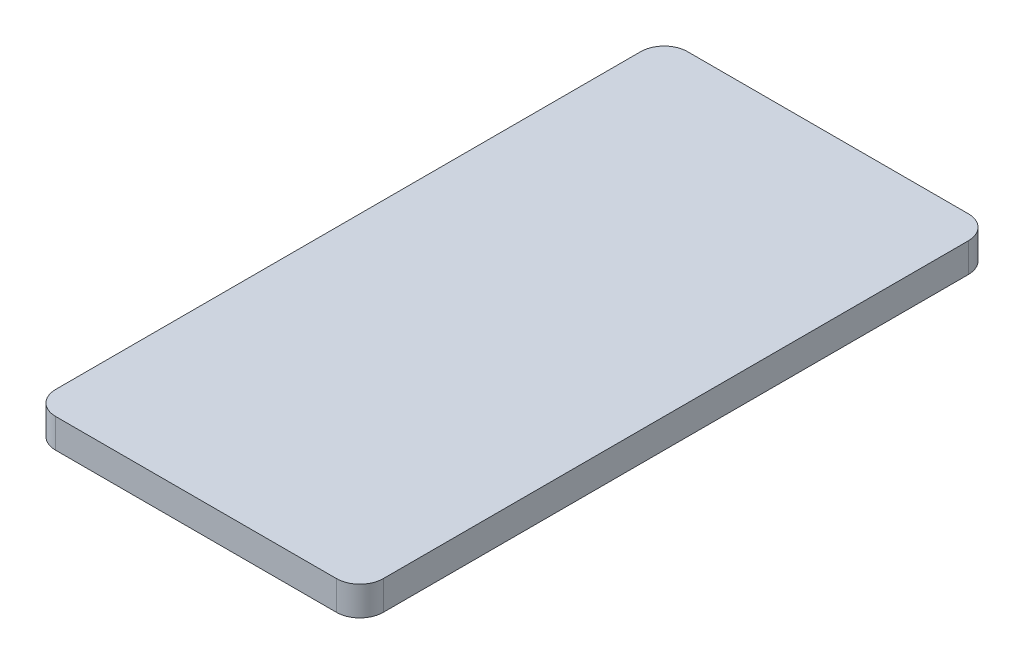
ISO-10303-21;
HEADER;
FILE_DESCRIPTION(('STEP AP214'),'2;1');
FILE_NAME('part.step','',(''),(''),'','','');
FILE_SCHEMA(('AUTOMOTIVE_DESIGN { 1 0 10303 214 1 1 1 1 }'));
ENDSEC;
DATA;
#1=APPLICATION_CONTEXT('core data for automotive mechanical design processes');
#2=APPLICATION_PROTOCOL_DEFINITION('international standard','automotive_design',2000,#1);
#3=PRODUCT_CONTEXT('',#1,'mechanical');
#4=PRODUCT('Part','Part','',(#3));
#5=PRODUCT_RELATED_PRODUCT_CATEGORY('part','',(#4));
#6=PRODUCT_DEFINITION_FORMATION('','',#4);
#7=PRODUCT_DEFINITION_CONTEXT('part definition',#1,'design');
#8=PRODUCT_DEFINITION('design','',#6,#7);
#9=PRODUCT_DEFINITION_SHAPE('','',#8);
#10=(LENGTH_UNIT() NAMED_UNIT(*) SI_UNIT(.MILLI.,.METRE.));
#11=(NAMED_UNIT(*) PLANE_ANGLE_UNIT() SI_UNIT($,.RADIAN.));
#12=(NAMED_UNIT(*) SI_UNIT($,.STERADIAN.) SOLID_ANGLE_UNIT());
#13=UNCERTAINTY_MEASURE_WITH_UNIT(LENGTH_MEASURE(1.E-05),#10,'distance_accuracy_value','');
#14=(GEOMETRIC_REPRESENTATION_CONTEXT(3) GLOBAL_UNCERTAINTY_ASSIGNED_CONTEXT((#13)) GLOBAL_UNIT_ASSIGNED_CONTEXT((#10,
#11,#12)) REPRESENTATION_CONTEXT('',''));
#15=CARTESIAN_POINT('',(0.,0.,0.));
#16=DIRECTION('',(0.,0.,1.));
#17=DIRECTION('',(1.,0.,0.));
#18=AXIS2_PLACEMENT_3D('',#15,#16,#17);
#19=CARTESIAN_POINT('',(15.24,3.175,31.75));
#20=DIRECTION('',(0.,-1.,0.));
#21=DIRECTION('',(0.,0.,-1.));
#22=AXIS2_PLACEMENT_3D('',#19,#20,#21);
#23=CYLINDRICAL_SURFACE('',#22,2.54);
#24=CARTESIAN_POINT('',(15.24,0.,31.75));
#25=DIRECTION('',(0.,1.,0.));
#26=DIRECTION('',(0.,0.,1.));
#27=AXIS2_PLACEMENT_3D('',#24,#25,#26);
#28=CIRCLE('',#27,2.54);
#29=CARTESIAN_POINT('',(15.24,0.,34.29));
#30=VERTEX_POINT('',#29);
#31=CARTESIAN_POINT('',(17.78,0.,31.75));
#32=VERTEX_POINT('',#31);
#33=EDGE_CURVE('E129',#30,#32,#28,.T.);
#34=ORIENTED_EDGE('',*,*,#33,.T.);
#35=DIRECTION('',(0.,-1.,0.));
#36=VECTOR('',#35,1.);
#37=CARTESIAN_POINT('',(17.78,3.175,31.75));
#38=LINE('',#37,#36);
#39=CARTESIAN_POINT('',(17.78,3.175,31.75));
#40=VERTEX_POINT('',#39);
#41=EDGE_CURVE('E11',#40,#32,#38,.T.);
#42=ORIENTED_EDGE('',*,*,#41,.F.);
#43=CARTESIAN_POINT('',(15.24,3.175,31.75));
#44=DIRECTION('',(0.,1.,0.));
#45=DIRECTION('',(0.,0.,1.));
#46=AXIS2_PLACEMENT_3D('',#43,#44,#45);
#47=CIRCLE('',#46,2.54);
#48=CARTESIAN_POINT('',(15.24,3.175,34.29));
#49=VERTEX_POINT('',#48);
#50=EDGE_CURVE('E143',#49,#40,#47,.T.);
#51=ORIENTED_EDGE('',*,*,#50,.F.);
#52=DIRECTION('',(0.,-1.,0.));
#53=VECTOR('',#52,1.);
#54=CARTESIAN_POINT('',(15.24,3.175,34.29));
#55=LINE('',#54,#53);
#56=EDGE_CURVE('E125',#49,#30,#55,.T.);
#57=ORIENTED_EDGE('',*,*,#56,.T.);
#58=EDGE_LOOP('',(#34,#42,#51,#57));
#59=FACE_BOUND('',#58,.T.);
#60=ADVANCED_FACE('F33',(#59),#23,.T.);
#61=CARTESIAN_POINT('',(17.78,3.175,31.75));
#62=DIRECTION('',(-1.,0.,0.));
#63=DIRECTION('',(0.,0.,1.));
#64=AXIS2_PLACEMENT_3D('',#61,#62,#63);
#65=PLANE('',#64);
#66=DIRECTION('',(0.,0.,-1.));
#67=VECTOR('',#66,1.);
#68=CARTESIAN_POINT('',(17.78,0.,31.75));
#69=LINE('',#68,#67);
#70=CARTESIAN_POINT('',(17.78,0.,-31.75));
#71=VERTEX_POINT('',#70);
#72=EDGE_CURVE('E132',#32,#71,#69,.T.);
#73=ORIENTED_EDGE('',*,*,#72,.T.);
#74=DIRECTION('',(0.,-1.,0.));
#75=VECTOR('',#74,1.);
#76=CARTESIAN_POINT('',(17.78,3.175,-31.75));
#77=LINE('',#76,#75);
#78=CARTESIAN_POINT('',(17.78,3.175,-31.75));
#79=VERTEX_POINT('',#78);
#80=EDGE_CURVE('E41',#79,#71,#77,.T.);
#81=ORIENTED_EDGE('',*,*,#80,.F.);
#82=DIRECTION('',(0.,0.,-1.));
#83=VECTOR('',#82,1.);
#84=CARTESIAN_POINT('',(17.78,3.175,31.75));
#85=LINE('',#84,#83);
#86=EDGE_CURVE('E92',#40,#79,#85,.T.);
#87=ORIENTED_EDGE('',*,*,#86,.F.);
#88=ORIENTED_EDGE('',*,*,#41,.T.);
#89=EDGE_LOOP('',(#73,#81,#87,#88));
#90=FACE_BOUND('',#89,.T.);
#91=ADVANCED_FACE('F178',(#90),#65,.F.);
#92=CARTESIAN_POINT('',(15.24,3.175,-31.75));
#93=DIRECTION('',(0.,-1.,0.));
#94=DIRECTION('',(0.,0.,-1.));
#95=AXIS2_PLACEMENT_3D('',#92,#93,#94);
#96=CYLINDRICAL_SURFACE('',#95,2.54);
#97=CARTESIAN_POINT('',(15.24,0.,-31.75));
#98=DIRECTION('',(0.,1.,0.));
#99=DIRECTION('',(0.,0.,-1.));
#100=AXIS2_PLACEMENT_3D('',#97,#98,#99);
#101=CIRCLE('',#100,2.54);
#102=CARTESIAN_POINT('',(15.24,0.,-34.29));
#103=VERTEX_POINT('',#102);
#104=EDGE_CURVE('E134',#71,#103,#101,.T.);
#105=ORIENTED_EDGE('',*,*,#104,.T.);
#106=DIRECTION('',(0.,-1.,0.));
#107=VECTOR('',#106,1.);
#108=CARTESIAN_POINT('',(15.24,3.175,-34.29));
#109=LINE('',#108,#107);
#110=CARTESIAN_POINT('',(15.24,3.175,-34.29));
#111=VERTEX_POINT('',#110);
#112=EDGE_CURVE('E150',#111,#103,#109,.T.);
#113=ORIENTED_EDGE('',*,*,#112,.F.);
#114=CARTESIAN_POINT('',(15.24,3.175,-31.75));
#115=DIRECTION('',(0.,1.,0.));
#116=DIRECTION('',(0.,0.,-1.));
#117=AXIS2_PLACEMENT_3D('',#114,#115,#116);
#118=CIRCLE('',#117,2.54);
#119=EDGE_CURVE('E158',#79,#111,#118,.T.);
#120=ORIENTED_EDGE('',*,*,#119,.F.);
#121=ORIENTED_EDGE('',*,*,#80,.T.);
#122=EDGE_LOOP('',(#105,#113,#120,#121));
#123=FACE_BOUND('',#122,.T.);
#124=ADVANCED_FACE('F156',(#123),#96,.T.);
#125=CARTESIAN_POINT('',(-15.24,3.175,-34.29));
#126=DIRECTION('',(0.,0.,1.));
#127=DIRECTION('',(1.,0.,0.));
#128=AXIS2_PLACEMENT_3D('',#125,#126,#127);
#129=PLANE('',#128);
#130=DIRECTION('',(-1.,0.,0.));
#131=VECTOR('',#130,1.);
#132=CARTESIAN_POINT('',(-15.24,0.,-34.29));
#133=LINE('',#132,#131);
#134=CARTESIAN_POINT('',(-15.24,0.,-34.29));
#135=VERTEX_POINT('',#134);
#136=EDGE_CURVE('E136',#103,#135,#133,.T.);
#137=ORIENTED_EDGE('',*,*,#136,.T.);
#138=DIRECTION('',(0.,-1.,0.));
#139=VECTOR('',#138,1.);
#140=CARTESIAN_POINT('',(-15.24,3.175,-34.29));
#141=LINE('',#140,#139);
#142=CARTESIAN_POINT('',(-15.24,3.175,-34.29));
#143=VERTEX_POINT('',#142);
#144=EDGE_CURVE('E147',#143,#135,#141,.T.);
#145=ORIENTED_EDGE('',*,*,#144,.F.);
#146=DIRECTION('',(-1.,0.,0.));
#147=VECTOR('',#146,1.);
#148=CARTESIAN_POINT('',(-15.24,3.175,-34.29));
#149=LINE('',#148,#147);
#150=EDGE_CURVE('E170',#111,#143,#149,.T.);
#151=ORIENTED_EDGE('',*,*,#150,.F.);
#152=ORIENTED_EDGE('',*,*,#112,.T.);
#153=EDGE_LOOP('',(#137,#145,#151,#152));
#154=FACE_BOUND('',#153,.T.);
#155=ADVANCED_FACE('F166',(#154),#129,.F.);
#156=CARTESIAN_POINT('',(-15.24,3.175,-31.75));
#157=DIRECTION('',(0.,-1.,0.));
#158=DIRECTION('',(0.,0.,-1.));
#159=AXIS2_PLACEMENT_3D('',#156,#157,#158);
#160=CYLINDRICAL_SURFACE('',#159,2.54);
#161=CARTESIAN_POINT('',(-15.24,0.,-31.75));
#162=DIRECTION('',(0.,1.,0.));
#163=DIRECTION('',(0.,0.,-1.));
#164=AXIS2_PLACEMENT_3D('',#161,#162,#163);
#165=CIRCLE('',#164,2.54);
#166=CARTESIAN_POINT('',(-17.78,0.,-31.75));
#167=VERTEX_POINT('',#166);
#168=EDGE_CURVE('E138',#135,#167,#165,.T.);
#169=ORIENTED_EDGE('',*,*,#168,.T.);
#170=DIRECTION('',(0.,-1.,0.));
#171=VECTOR('',#170,1.);
#172=CARTESIAN_POINT('',(-17.78,3.175,-31.75));
#173=LINE('',#172,#171);
#174=CARTESIAN_POINT('',(-17.78,3.175,-31.75));
#175=VERTEX_POINT('',#174);
#176=EDGE_CURVE('E120',#175,#167,#173,.T.);
#177=ORIENTED_EDGE('',*,*,#176,.F.);
#178=CARTESIAN_POINT('',(-15.24,3.175,-31.75));
#179=DIRECTION('',(0.,1.,0.));
#180=DIRECTION('',(0.,0.,-1.));
#181=AXIS2_PLACEMENT_3D('',#178,#179,#180);
#182=CIRCLE('',#181,2.54);
#183=EDGE_CURVE('E111',#143,#175,#182,.T.);
#184=ORIENTED_EDGE('',*,*,#183,.F.);
#185=ORIENTED_EDGE('',*,*,#144,.T.);
#186=EDGE_LOOP('',(#169,#177,#184,#185));
#187=FACE_BOUND('',#186,.T.);
#188=ADVANCED_FACE('F169',(#187),#160,.T.);
#189=CARTESIAN_POINT('',(-17.78,3.175,31.75));
#190=DIRECTION('',(1.,0.,0.));
#191=DIRECTION('',(0.,0.,-1.));
#192=AXIS2_PLACEMENT_3D('',#189,#190,#191);
#193=PLANE('',#192);
#194=DIRECTION('',(0.,0.,1.));
#195=VECTOR('',#194,1.);
#196=CARTESIAN_POINT('',(-17.78,0.,31.75));
#197=LINE('',#196,#195);
#198=CARTESIAN_POINT('',(-17.78,0.,31.75));
#199=VERTEX_POINT('',#198);
#200=EDGE_CURVE('E119',#167,#199,#197,.T.);
#201=ORIENTED_EDGE('',*,*,#200,.T.);
#202=DIRECTION('',(0.,-1.,0.));
#203=VECTOR('',#202,1.);
#204=CARTESIAN_POINT('',(-17.78,3.175,31.75));
#205=LINE('',#204,#203);
#206=CARTESIAN_POINT('',(-17.78,3.175,31.75));
#207=VERTEX_POINT('',#206);
#208=EDGE_CURVE('E116',#207,#199,#205,.T.);
#209=ORIENTED_EDGE('',*,*,#208,.F.);
#210=DIRECTION('',(0.,0.,1.));
#211=VECTOR('',#210,1.);
#212=CARTESIAN_POINT('',(-17.78,3.175,31.75));
#213=LINE('',#212,#211);
#214=EDGE_CURVE('E105',#175,#207,#213,.T.);
#215=ORIENTED_EDGE('',*,*,#214,.F.);
#216=ORIENTED_EDGE('',*,*,#176,.T.);
#217=EDGE_LOOP('',(#201,#209,#215,#216));
#218=FACE_BOUND('',#217,.T.);
#219=ADVANCED_FACE('F117',(#218),#193,.F.);
#220=CARTESIAN_POINT('',(-15.24,3.175,31.75));
#221=DIRECTION('',(0.,-1.,0.));
#222=DIRECTION('',(0.,0.,-1.));
#223=AXIS2_PLACEMENT_3D('',#220,#221,#222);
#224=CYLINDRICAL_SURFACE('',#223,2.54);
#225=CARTESIAN_POINT('',(-15.24,0.,31.75));
#226=DIRECTION('',(0.,1.,0.));
#227=DIRECTION('',(0.,0.,-1.));
#228=AXIS2_PLACEMENT_3D('',#225,#226,#227);
#229=CIRCLE('',#228,2.54);
#230=CARTESIAN_POINT('',(-15.24,0.,34.29));
#231=VERTEX_POINT('',#230);
#232=EDGE_CURVE('E78',#199,#231,#229,.T.);
#233=ORIENTED_EDGE('',*,*,#232,.T.);
#234=DIRECTION('',(0.,-1.,0.));
#235=VECTOR('',#234,1.);
#236=CARTESIAN_POINT('',(-15.24,3.175,34.29));
#237=LINE('',#236,#235);
#238=CARTESIAN_POINT('',(-15.24,3.175,34.29));
#239=VERTEX_POINT('',#238);
#240=EDGE_CURVE('E121',#239,#231,#237,.T.);
#241=ORIENTED_EDGE('',*,*,#240,.F.);
#242=CARTESIAN_POINT('',(-15.24,3.175,31.75));
#243=DIRECTION('',(0.,1.,0.));
#244=DIRECTION('',(0.,0.,-1.));
#245=AXIS2_PLACEMENT_3D('',#242,#243,#244);
#246=CIRCLE('',#245,2.54);
#247=EDGE_CURVE('E109',#207,#239,#246,.T.);
#248=ORIENTED_EDGE('',*,*,#247,.F.);
#249=ORIENTED_EDGE('',*,*,#208,.T.);
#250=EDGE_LOOP('',(#233,#241,#248,#249));
#251=FACE_BOUND('',#250,.T.);
#252=ADVANCED_FACE('F123',(#251),#224,.T.);
#253=CARTESIAN_POINT('',(-15.24,3.175,34.29));
#254=DIRECTION('',(0.,0.,-1.));
#255=DIRECTION('',(-1.,0.,0.));
#256=AXIS2_PLACEMENT_3D('',#253,#254,#255);
#257=PLANE('',#256);
#258=DIRECTION('',(1.,0.,0.));
#259=VECTOR('',#258,1.);
#260=CARTESIAN_POINT('',(-15.24,0.,34.29));
#261=LINE('',#260,#259);
#262=EDGE_CURVE('E84',#231,#30,#261,.T.);
#263=ORIENTED_EDGE('',*,*,#262,.T.);
#264=ORIENTED_EDGE('',*,*,#56,.F.);
#265=DIRECTION('',(1.,0.,0.));
#266=VECTOR('',#265,1.);
#267=CARTESIAN_POINT('',(-15.24,3.175,34.29));
#268=LINE('',#267,#266);
#269=EDGE_CURVE('E49',#239,#49,#268,.T.);
#270=ORIENTED_EDGE('',*,*,#269,.F.);
#271=ORIENTED_EDGE('',*,*,#240,.T.);
#272=EDGE_LOOP('',(#263,#264,#270,#271));
#273=FACE_BOUND('',#272,.T.);
#274=ADVANCED_FACE('F194',(#273),#257,.F.);
#275=CARTESIAN_POINT('',(15.24,3.175,31.75));
#276=DIRECTION('',(0.,1.,0.));
#277=DIRECTION('',(0.,0.,1.));
#278=AXIS2_PLACEMENT_3D('',#275,#276,#277);
#279=PLANE('',#278);
#280=ORIENTED_EDGE('',*,*,#50,.T.);
#281=ORIENTED_EDGE('',*,*,#86,.T.);
#282=ORIENTED_EDGE('',*,*,#119,.T.);
#283=ORIENTED_EDGE('',*,*,#150,.T.);
#284=ORIENTED_EDGE('',*,*,#183,.T.);
#285=ORIENTED_EDGE('',*,*,#214,.T.);
#286=ORIENTED_EDGE('',*,*,#247,.T.);
#287=ORIENTED_EDGE('',*,*,#269,.T.);
#288=EDGE_LOOP('',(#280,#281,#282,#283,#284,#285,#286,#287));
#289=FACE_BOUND('',#288,.T.);
#290=ADVANCED_FACE('F107',(#289),#279,.T.);
#291=CARTESIAN_POINT('',(15.24,0.,31.75));
#292=DIRECTION('',(0.,1.,0.));
#293=DIRECTION('',(0.,0.,1.));
#294=AXIS2_PLACEMENT_3D('',#291,#292,#293);
#295=PLANE('',#294);
#296=ORIENTED_EDGE('',*,*,#33,.F.);
#297=ORIENTED_EDGE('',*,*,#262,.F.);
#298=ORIENTED_EDGE('',*,*,#232,.F.);
#299=ORIENTED_EDGE('',*,*,#200,.F.);
#300=ORIENTED_EDGE('',*,*,#168,.F.);
#301=ORIENTED_EDGE('',*,*,#136,.F.);
#302=ORIENTED_EDGE('',*,*,#104,.F.);
#303=ORIENTED_EDGE('',*,*,#72,.F.);
#304=EDGE_LOOP('',(#296,#297,#298,#299,#300,#301,#302,#303));
#305=FACE_BOUND('',#304,.T.);
#306=ADVANCED_FACE('F162',(#305),#295,.F.);
#307=CLOSED_SHELL('',(#60,#91,#124,#155,#188,#219,#252,#274,#290,#306));
#308=MANIFOLD_SOLID_BREP('B2',#307);
#309=ADVANCED_BREP_SHAPE_REPRESENTATION('',(#18,#308),#14);
#310=SHAPE_DEFINITION_REPRESENTATION(#9,#309);
ENDSEC;
END-ISO-10303-21;
